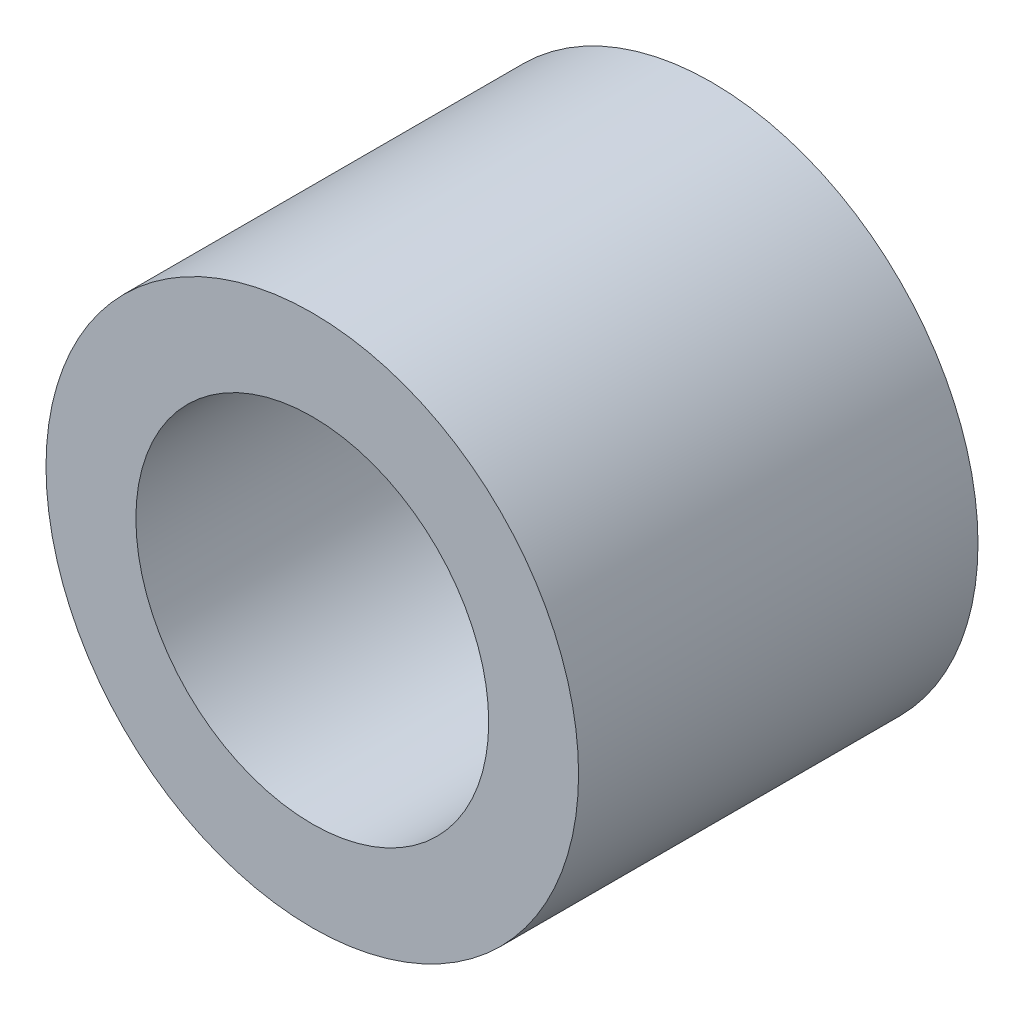
ISO-10303-21;
HEADER;
FILE_DESCRIPTION(('STEP AP214'),'2;1');
FILE_NAME('part.step','',(''),(''),'','','');
FILE_SCHEMA(('AUTOMOTIVE_DESIGN { 1 0 10303 214 1 1 1 1 }'));
ENDSEC;
DATA;
#1=APPLICATION_CONTEXT('core data for automotive mechanical design processes');
#2=APPLICATION_PROTOCOL_DEFINITION('international standard','automotive_design',2000,#1);
#3=PRODUCT_CONTEXT('',#1,'mechanical');
#4=PRODUCT('Part','Part','',(#3));
#5=PRODUCT_RELATED_PRODUCT_CATEGORY('part','',(#4));
#6=PRODUCT_DEFINITION_FORMATION('','',#4);
#7=PRODUCT_DEFINITION_CONTEXT('part definition',#1,'design');
#8=PRODUCT_DEFINITION('design','',#6,#7);
#9=PRODUCT_DEFINITION_SHAPE('','',#8);
#10=(LENGTH_UNIT() NAMED_UNIT(*) SI_UNIT(.MILLI.,.METRE.));
#11=(NAMED_UNIT(*) PLANE_ANGLE_UNIT() SI_UNIT($,.RADIAN.));
#12=(NAMED_UNIT(*) SI_UNIT($,.STERADIAN.) SOLID_ANGLE_UNIT());
#13=UNCERTAINTY_MEASURE_WITH_UNIT(LENGTH_MEASURE(1.E-05),#10,'distance_accuracy_value','');
#14=(GEOMETRIC_REPRESENTATION_CONTEXT(3) GLOBAL_UNCERTAINTY_ASSIGNED_CONTEXT((#13)) GLOBAL_UNIT_ASSIGNED_CONTEXT((#10,
#11,#12)) REPRESENTATION_CONTEXT('',''));
#15=CARTESIAN_POINT('',(0.,0.,0.));
#16=DIRECTION('',(0.,0.,1.));
#17=DIRECTION('',(1.,0.,0.));
#18=AXIS2_PLACEMENT_3D('',#15,#16,#17);
#19=CARTESIAN_POINT('',(0.,0.,3.));
#20=DIRECTION('',(0.,0.,1.));
#21=DIRECTION('',(1.,0.,0.));
#22=AXIS2_PLACEMENT_3D('',#19,#20,#21);
#23=PLANE('',#22);
#24=CARTESIAN_POINT('',(0.,0.,3.));
#25=DIRECTION('',(0.,0.,1.));
#26=DIRECTION('',(1.,0.,0.));
#27=AXIS2_PLACEMENT_3D('',#24,#25,#26);
#28=CIRCLE('',#27,4.);
#29=CARTESIAN_POINT('',(4.,0.,3.));
#30=VERTEX_POINT('',#29);
#31=EDGE_CURVE('E10',#30,#30,#28,.T.);
#32=ORIENTED_EDGE('',*,*,#31,.T.);
#33=EDGE_LOOP('',(#32));
#34=FACE_BOUND('',#33,.T.);
#35=CARTESIAN_POINT('',(0.,0.,3.));
#36=DIRECTION('',(0.,0.,1.));
#37=DIRECTION('',(1.,0.,0.));
#38=AXIS2_PLACEMENT_3D('',#35,#36,#37);
#39=CIRCLE('',#38,2.65);
#40=CARTESIAN_POINT('',(2.65,0.,3.));
#41=VERTEX_POINT('',#40);
#42=EDGE_CURVE('E39',#41,#41,#39,.T.);
#43=ORIENTED_EDGE('',*,*,#42,.F.);
#44=EDGE_LOOP('',(#43));
#45=FACE_BOUND('',#44,.T.);
#46=ADVANCED_FACE('F32',(#34,#45),#23,.T.);
#47=CARTESIAN_POINT('',(0.,0.,3.));
#48=DIRECTION('',(0.,0.,-1.));
#49=DIRECTION('',(-1.,0.,0.));
#50=AXIS2_PLACEMENT_3D('',#47,#48,#49);
#51=CYLINDRICAL_SURFACE('',#50,4.);
#52=ORIENTED_EDGE('',*,*,#31,.F.);
#53=EDGE_LOOP('',(#52));
#54=FACE_BOUND('',#53,.T.);
#55=CARTESIAN_POINT('',(0.,0.,-3.));
#56=DIRECTION('',(0.,0.,1.));
#57=DIRECTION('',(1.,0.,0.));
#58=AXIS2_PLACEMENT_3D('',#55,#56,#57);
#59=CIRCLE('',#58,4.);
#60=CARTESIAN_POINT('',(4.,0.,-3.));
#61=VERTEX_POINT('',#60);
#62=EDGE_CURVE('E43',#61,#61,#59,.T.);
#63=ORIENTED_EDGE('',*,*,#62,.T.);
#64=EDGE_LOOP('',(#63));
#65=FACE_BOUND('',#64,.T.);
#66=ADVANCED_FACE('F34',(#54,#65),#51,.T.);
#67=CARTESIAN_POINT('',(0.,0.,3.));
#68=DIRECTION('',(0.,0.,-1.));
#69=DIRECTION('',(-1.,0.,0.));
#70=AXIS2_PLACEMENT_3D('',#67,#68,#69);
#71=CYLINDRICAL_SURFACE('',#70,2.65);
#72=ORIENTED_EDGE('',*,*,#42,.T.);
#73=EDGE_LOOP('',(#72));
#74=FACE_BOUND('',#73,.T.);
#75=CARTESIAN_POINT('',(0.,0.,-3.));
#76=DIRECTION('',(0.,0.,1.));
#77=DIRECTION('',(1.,0.,0.));
#78=AXIS2_PLACEMENT_3D('',#75,#76,#77);
#79=CIRCLE('',#78,2.65);
#80=CARTESIAN_POINT('',(2.65,0.,-3.));
#81=VERTEX_POINT('',#80);
#82=EDGE_CURVE('E47',#81,#81,#79,.T.);
#83=ORIENTED_EDGE('',*,*,#82,.F.);
#84=EDGE_LOOP('',(#83));
#85=FACE_BOUND('',#84,.T.);
#86=ADVANCED_FACE('F56',(#74,#85),#71,.F.);
#87=CARTESIAN_POINT('',(0.,0.,-3.));
#88=DIRECTION('',(0.,0.,1.));
#89=DIRECTION('',(1.,0.,0.));
#90=AXIS2_PLACEMENT_3D('',#87,#88,#89);
#91=PLANE('',#90);
#92=ORIENTED_EDGE('',*,*,#82,.T.);
#93=EDGE_LOOP('',(#92));
#94=FACE_BOUND('',#93,.T.);
#95=ORIENTED_EDGE('',*,*,#62,.F.);
#96=EDGE_LOOP('',(#95));
#97=FACE_BOUND('',#96,.T.);
#98=ADVANCED_FACE('F53',(#94,#97),#91,.F.);
#99=CLOSED_SHELL('',(#46,#66,#86,#98));
#100=MANIFOLD_SOLID_BREP('B2',#99);
#101=ADVANCED_BREP_SHAPE_REPRESENTATION('',(#18,#100),#14);
#102=SHAPE_DEFINITION_REPRESENTATION(#9,#101);
ENDSEC;
END-ISO-10303-21;
